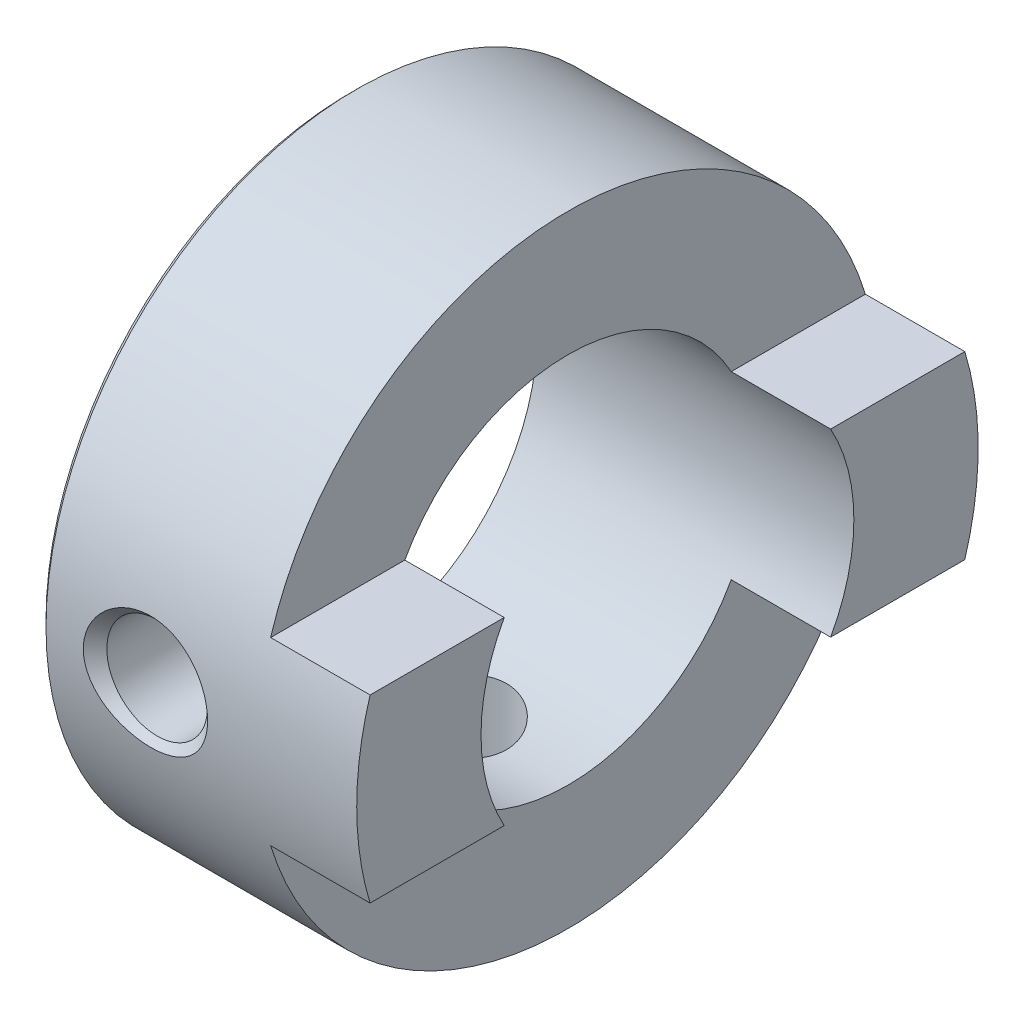
ISO-10303-21;
HEADER;
FILE_DESCRIPTION(('STEP AP214'),'2;1');
FILE_NAME('part.step','',(''),(''),'','','');
FILE_SCHEMA(('AUTOMOTIVE_DESIGN { 1 0 10303 214 1 1 1 1 }'));
ENDSEC;
DATA;
#1=APPLICATION_CONTEXT('core data for automotive mechanical design processes');
#2=APPLICATION_PROTOCOL_DEFINITION('international standard','automotive_design',2000,#1);
#3=PRODUCT_CONTEXT('',#1,'mechanical');
#4=PRODUCT('Part','Part','',(#3));
#5=PRODUCT_RELATED_PRODUCT_CATEGORY('part','',(#4));
#6=PRODUCT_DEFINITION_FORMATION('','',#4);
#7=PRODUCT_DEFINITION_CONTEXT('part definition',#1,'design');
#8=PRODUCT_DEFINITION('design','',#6,#7);
#9=PRODUCT_DEFINITION_SHAPE('','',#8);
#10=(LENGTH_UNIT() NAMED_UNIT(*) SI_UNIT(.MILLI.,.METRE.));
#11=(NAMED_UNIT(*) PLANE_ANGLE_UNIT() SI_UNIT($,.RADIAN.));
#12=(NAMED_UNIT(*) SI_UNIT($,.STERADIAN.) SOLID_ANGLE_UNIT());
#13=UNCERTAINTY_MEASURE_WITH_UNIT(LENGTH_MEASURE(1.E-05),#10,'distance_accuracy_value','');
#14=(GEOMETRIC_REPRESENTATION_CONTEXT(3) GLOBAL_UNCERTAINTY_ASSIGNED_CONTEXT((#13)) GLOBAL_UNIT_ASSIGNED_CONTEXT((#10,
#11,#12)) REPRESENTATION_CONTEXT('',''));
#15=CARTESIAN_POINT('',(0.,0.,0.));
#16=DIRECTION('',(0.,0.,1.));
#17=DIRECTION('',(1.,0.,0.));
#18=AXIS2_PLACEMENT_3D('',#15,#16,#17);
#19=CARTESIAN_POINT('',(10.2,0.,0.));
#20=DIRECTION('',(-1.,0.,0.));
#21=DIRECTION('',(0.,0.,1.));
#22=AXIS2_PLACEMENT_3D('',#19,#20,#21);
#23=CYLINDRICAL_SURFACE('',#22,6.);
#24=CARTESIAN_POINT('',(5.021,0.,6.));
#25=CARTESIAN_POINT('',(5.02099797128969,-0.0893178155734748,5.99999869766671));
#26=CARTESIAN_POINT('',(5.01359309732777,-0.178657194675937,5.99798600953487));
#27=CARTESIAN_POINT('',(4.98422344309247,-0.354759509310627,5.99015257126376));
#28=CARTESIAN_POINT('',(4.96225192551784,-0.44152123322692,5.98433005903733));
#29=CARTESIAN_POINT('',(4.90451758434842,-0.60990103470308,5.96951916261518));
#30=CARTESIAN_POINT('',(4.86877280377917,-0.691525679787921,5.96053492162512));
#31=CARTESIAN_POINT('',(4.78457421147819,-0.847621750129845,5.94034845696021));
#32=CARTESIAN_POINT('',(4.73611946430083,-0.922092648324216,5.92914607004609));
#33=CARTESIAN_POINT('',(4.62666183586585,-1.0635356052801,5.90543389683063));
#34=CARTESIAN_POINT('',(4.56541312476875,-1.13031360410209,5.89290130274946));
#35=CARTESIAN_POINT('',(4.43263153576884,-1.25278598900679,5.86808659508087));
#36=CARTESIAN_POINT('',(4.36109729867565,-1.30847890791856,5.85580451484316));
#37=CARTESIAN_POINT('',(4.20821701200546,-1.40815381279465,5.83264738302036));
#38=CARTESIAN_POINT('',(4.12671977339304,-1.45191119704436,5.82180106621877));
#39=CARTESIAN_POINT('',(3.95718459810715,-1.5250257465979,5.80307942536656));
#40=CARTESIAN_POINT('',(3.86914790663358,-1.55438564532451,5.79520353743323));
#41=CARTESIAN_POINT('',(3.69118522189785,-1.59719525057127,5.78355019076216));
#42=CARTESIAN_POINT('',(3.6013500936885,-1.61099741380277,5.77968210751179));
#43=CARTESIAN_POINT('',(3.42056257149747,-1.62339878491541,5.77621168000457));
#44=CARTESIAN_POINT('',(3.32961039562181,-1.62200091494071,5.77660851583432));
#45=CARTESIAN_POINT('',(3.15193273697882,-1.60432141484187,5.78154205648002));
#46=CARTESIAN_POINT('',(3.06516083967689,-1.58846772522148,5.78595972445398));
#47=CARTESIAN_POINT('',(2.89555679855742,-1.54301261441731,5.79824637257391));
#48=CARTESIAN_POINT('',(2.8127249776326,-1.51341006863516,5.80611563504281));
#49=CARTESIAN_POINT('',(2.65224382489695,-1.44095225763224,5.82452249254489));
#50=CARTESIAN_POINT('',(2.57466526983474,-1.39794810460614,5.83508981113179));
#51=CARTESIAN_POINT('',(2.42767590097968,-1.30001163104086,5.8576863033876));
#52=CARTESIAN_POINT('',(2.35826673755287,-1.24507690666454,5.86971577144303));
#53=CARTESIAN_POINT('',(2.22714311552469,-1.12265684317158,5.89437537730546));
#54=CARTESIAN_POINT('',(2.16576455161414,-1.05481254542755,5.90701213368907));
#55=CARTESIAN_POINT('',(2.05518632276558,-0.909638932121591,5.93110133057478));
#56=CARTESIAN_POINT('',(2.00598716324778,-0.832309223133706,5.94255372191669));
#57=CARTESIAN_POINT('',(1.92101099151845,-0.669830766272388,5.96305737158012));
#58=CARTESIAN_POINT('',(1.88529612706271,-0.584648012712029,5.97209745709705));
#59=CARTESIAN_POINT('',(1.82879138186152,-0.409187033686591,5.98667722542695));
#60=CARTESIAN_POINT('',(1.8079981506913,-0.318909956987408,5.99221769399195));
#61=CARTESIAN_POINT('',(1.78245747159978,-0.138688433319267,5.99905458941442));
#62=CARTESIAN_POINT('',(1.77725350038695,-0.0488131654021478,6.0004717290828));
#63=CARTESIAN_POINT('',(1.78177643710448,0.130526409668287,5.99925005711715));
#64=CARTESIAN_POINT('',(1.79150175785342,0.219990759493474,5.99661167663858));
#65=CARTESIAN_POINT('',(1.82523322094882,0.394330179937581,5.98765350478806));
#66=CARTESIAN_POINT('',(1.84898351767584,0.479258455257369,5.98139970825382));
#67=CARTESIAN_POINT('',(1.90979258324628,0.643916151033864,5.96592128041494));
#68=CARTESIAN_POINT('',(1.94685281335131,0.723644999523493,5.95669632292607));
#69=CARTESIAN_POINT('',(2.03406836710344,0.877405183775287,5.9360174505753));
#70=CARTESIAN_POINT('',(2.08447044340841,0.95129092645926,5.9245226986249));
#71=CARTESIAN_POINT('',(2.19662983518082,1.08971573563863,5.90063234516808));
#72=CARTESIAN_POINT('',(2.25838945491103,1.15425290069958,5.88823656116593));
#73=CARTESIAN_POINT('',(2.39364319297356,1.27408126291954,5.86349508365652));
#74=CARTESIAN_POINT('',(2.46742569300258,1.32905001767021,5.85116126961638));
#75=CARTESIAN_POINT('',(2.62342963530192,1.42583446109678,5.82833407528389));
#76=CARTESIAN_POINT('',(2.70565073320918,1.46765068621945,5.81784061993733));
#77=CARTESIAN_POINT('',(2.8757977507616,1.53662901368237,5.8000035617364));
#78=CARTESIAN_POINT('',(2.96368766567808,1.56387502411419,5.79264197416219));
#79=CARTESIAN_POINT('',(3.14303519995224,1.60313157795705,5.78190204361637));
#80=CARTESIAN_POINT('',(3.23449187147609,1.6151461409345,5.77852264976372));
#81=CARTESIAN_POINT('',(3.41507104766682,1.62336310160736,5.7762191499436));
#82=CARTESIAN_POINT('',(3.50416842282545,1.62008442858768,5.7771488220902));
#83=CARTESIAN_POINT('',(3.68048917065991,1.59901521817866,5.78301542833379));
#84=CARTESIAN_POINT('',(3.76771259393585,1.58122507313222,5.78795225409038));
#85=CARTESIAN_POINT('',(3.93713697149612,1.53194240358803,5.80118871626251));
#86=CARTESIAN_POINT('',(4.01937302562551,1.50056258099866,5.8094606557885));
#87=CARTESIAN_POINT('',(4.17747596673851,1.42507869802279,5.82843533580544));
#88=CARTESIAN_POINT('',(4.25334182817667,1.38097259386722,5.83913846667322));
#89=CARTESIAN_POINT('',(4.39902104871236,1.27972706921922,5.86217253803533));
#90=CARTESIAN_POINT('',(4.46858302330213,1.2222348484132,5.87454282185139));
#91=CARTESIAN_POINT('',(4.59724055279467,1.09651643684242,5.8993007508124));
#92=CARTESIAN_POINT('',(4.65633354398535,1.02828762453482,5.91168839946325));
#93=CARTESIAN_POINT('',(4.76366332079701,0.881210831733843,5.93541327051416));
#94=CARTESIAN_POINT('',(4.81163087542786,0.8021612388799,5.94672117517279));
#95=CARTESIAN_POINT('',(4.89352083722484,0.636816710416051,5.96668902060251));
#96=CARTESIAN_POINT('',(4.92745202136758,0.550526343212495,5.97535061522904));
#97=CARTESIAN_POINT('',(4.97601572387091,0.38716318842334,5.98796540211035));
#98=CARTESIAN_POINT('',(4.99284502784698,0.310776986652896,5.99244506486441));
#99=CARTESIAN_POINT('',(5.01533746999138,0.156265903088305,5.99846277981722));
#100=CARTESIAN_POINT('',(5.02100177485157,0.078141203822159,6.00000113936834));
#101=CARTESIAN_POINT('',(5.021,0.,6.));
#102=B_SPLINE_CURVE_WITH_KNOTS('',3,(#24,#25,#26,#27,#28,#29,#30,#31,#32,#33,#34,#35,#36,#37,
#38,#39,#40,#41,#42,#43,#44,#45,#46,#47,#48,#49,#50,#51,#52,#53,#54,#55,#56,#57,#58,#59,#60,#61,
#62,#63,#64,#65,#66,#67,#68,#69,#70,#71,#72,#73,#74,#75,#76,#77,#78,#79,#80,#81,#82,#83,#84,#85,
#86,#87,#88,#89,#90,#91,#92,#93,#94,#95,#96,#97,#98,#99,#100,#101),.UNSPECIFIED.,.T.,.F.,(4,2,2,
2,2,2,2,2,2,2,2,2,2,2,2,2,2,2,2,2,2,2,2,2,2,2,2,2,2,2,2,2,2,2,2,2,2,2,4),(0.,0.267666837034827,
0.535457560629673,0.802898663541019,1.07035945547648,1.34353089113733,1.61673845852414,
1.89477920728221,2.172767148386,2.44432214471736,2.71582493663529,2.97954239914872,
3.24328143643665,3.51006179059311,3.77689594707443,4.05267396774227,4.32846343071233,
4.6055088977465,4.88249213897389,5.15128067150215,5.42004063022915,5.68404301888905,
5.94807440052234,6.21737901834858,6.48673833414675,6.763909766522,7.04106989255473,
7.31661621277422,7.59208980139977,7.85828536269188,8.12447372716245,8.38849558902952,
8.65255987494063,8.92458415314723,9.1966749546067,9.47478799685191,9.75272687049906,
9.98692421048726,10.2210970766157),.UNSPECIFIED.);
#103=CARTESIAN_POINT('',(5.021,0.,6.));
#104=VERTEX_POINT('',#103);
#105=EDGE_CURVE('E147',#104,#104,#102,.T.);
#106=ORIENTED_EDGE('',*,*,#105,.F.);
#107=EDGE_LOOP('',(#106));
#108=FACE_BOUND('',#107,.T.);
#109=CARTESIAN_POINT('',(0.,0.,0.));
#110=DIRECTION('',(-1.,0.,0.));
#111=DIRECTION('',(0.,0.,1.));
#112=AXIS2_PLACEMENT_3D('',#109,#110,#111);
#113=CIRCLE('',#112,6.);
#114=CARTESIAN_POINT('',(0.,0.,6.));
#115=VERTEX_POINT('',#114);
#116=EDGE_CURVE('E200',#115,#115,#113,.T.);
#117=ORIENTED_EDGE('',*,*,#116,.T.);
#118=EDGE_LOOP('',(#117));
#119=FACE_BOUND('',#118,.T.);
#120=DIRECTION('',(-1.,0.,0.));
#121=VECTOR('',#120,1.);
#122=CARTESIAN_POINT('',(10.2,2.9,-5.25261839466756));
#123=LINE('',#122,#121);
#124=CARTESIAN_POINT('',(7.,2.9,-5.25261839466756));
#125=VERTEX_POINT('',#124);
#126=CARTESIAN_POINT('',(10.2,2.9,-5.25261839466756));
#127=VERTEX_POINT('',#126);
#128=EDGE_CURVE('E215',#125,#127,#123,.F.);
#129=ORIENTED_EDGE('',*,*,#128,.F.);
#130=CARTESIAN_POINT('',(7.,0.,0.));
#131=DIRECTION('',(1.,0.,0.));
#132=DIRECTION('',(0.,0.,-1.));
#133=AXIS2_PLACEMENT_3D('',#130,#131,#132);
#134=CIRCLE('',#133,6.);
#135=CARTESIAN_POINT('',(7.,2.9,5.25261839466756));
#136=VERTEX_POINT('',#135);
#137=EDGE_CURVE('E213',#136,#125,#134,.F.);
#138=ORIENTED_EDGE('',*,*,#137,.F.);
#139=DIRECTION('',(-1.,0.,0.));
#140=VECTOR('',#139,1.);
#141=CARTESIAN_POINT('',(10.2,2.9,5.25261839466756));
#142=LINE('',#141,#140);
#143=CARTESIAN_POINT('',(10.2,2.9,5.25261839466756));
#144=VERTEX_POINT('',#143);
#145=EDGE_CURVE('E217',#144,#136,#142,.T.);
#146=ORIENTED_EDGE('',*,*,#145,.F.);
#147=CARTESIAN_POINT('',(10.2,0.,0.));
#148=DIRECTION('',(-1.,0.,0.));
#149=DIRECTION('',(0.,0.,1.));
#150=AXIS2_PLACEMENT_3D('',#147,#148,#149);
#151=CIRCLE('',#150,6.);
#152=CARTESIAN_POINT('',(10.2,-2.9,5.25261839466756));
#153=VERTEX_POINT('',#152);
#154=EDGE_CURVE('E113',#153,#144,#151,.T.);
#155=ORIENTED_EDGE('',*,*,#154,.F.);
#156=DIRECTION('',(-1.,0.,0.));
#157=VECTOR('',#156,1.);
#158=CARTESIAN_POINT('',(10.2,-2.9,5.25261839466756));
#159=LINE('',#158,#157);
#160=CARTESIAN_POINT('',(7.,-2.9,5.25261839466756));
#161=VERTEX_POINT('',#160);
#162=EDGE_CURVE('E122',#161,#153,#159,.F.);
#163=ORIENTED_EDGE('',*,*,#162,.F.);
#164=CARTESIAN_POINT('',(7.,-2.9,-5.25261839466756));
#165=VERTEX_POINT('',#164);
#166=EDGE_CURVE('E212',#165,#161,#134,.F.);
#167=ORIENTED_EDGE('',*,*,#166,.F.);
#168=DIRECTION('',(-1.,0.,0.));
#169=VECTOR('',#168,1.);
#170=CARTESIAN_POINT('',(10.2,-2.9,-5.25261839466756));
#171=LINE('',#170,#169);
#172=CARTESIAN_POINT('',(10.2,-2.9,-5.25261839466756));
#173=VERTEX_POINT('',#172);
#174=EDGE_CURVE('E220',#173,#165,#171,.T.);
#175=ORIENTED_EDGE('',*,*,#174,.F.);
#176=EDGE_CURVE('E205',#127,#173,#151,.T.);
#177=ORIENTED_EDGE('',*,*,#176,.F.);
#178=EDGE_LOOP('',(#129,#138,#146,#155,#163,#167,#175,#177));
#179=FACE_BOUND('',#178,.T.);
#180=CARTESIAN_POINT('',(3.4,-5.77688142512896,-1.621));
#181=CARTESIAN_POINT('',(3.31074928785364,-5.7768829276281,-1.62099793859175));
#182=CARTESIAN_POINT('',(3.22147695108925,-5.77897237577596,-1.61360380143992));
#183=CARTESIAN_POINT('',(3.04551364733211,-5.78707859280927,-1.58428065311885));
#184=CARTESIAN_POINT('',(2.95882395221638,-5.79309726435535,-1.56234460019087));
#185=CARTESIAN_POINT('',(2.79059701236661,-5.80833162683327,-1.50471387730059));
#186=CARTESIAN_POINT('',(2.70905258608303,-5.81754273973761,-1.46903890114086));
#187=CARTESIAN_POINT('',(2.55309268323497,-5.83811825276231,-1.38500504174082));
#188=CARTESIAN_POINT('',(2.47867781463297,-5.84948283627106,-1.33664507811896));
#189=CARTESIAN_POINT('',(2.33717905838054,-5.87341173164873,-1.22728632254164));
#190=CARTESIAN_POINT('',(2.27030529627221,-5.88599775995091,-1.16602034508425));
#191=CARTESIAN_POINT('',(2.14764597271455,-5.91076417527509,-1.03316310413278));
#192=CARTESIAN_POINT('',(2.09186158657116,-5.92294451918691,-0.961570747584917));
#193=CARTESIAN_POINT('',(1.99208471129839,-5.94576993756795,-0.808632185731095));
#194=CARTESIAN_POINT('',(1.94830165532409,-5.95638640952564,-0.727144706731885));
#195=CARTESIAN_POINT('',(1.87513703567838,-5.97463840943899,-0.557630283353634));
#196=CARTESIAN_POINT('',(1.84575297691104,-5.98227445380426,-0.469604474999887));
#197=CARTESIAN_POINT('',(1.80290204237024,-5.99355165775663,-0.291705935816276));
#198=CARTESIAN_POINT('',(1.78907760214562,-5.99728241459448,-0.201925112090299));
#199=CARTESIAN_POINT('',(1.77661280199322,-6.00064217938617,-0.0212462103129114));
#200=CARTESIAN_POINT('',(1.77796983612933,-6.00027189129423,0.0696516733168152));
#201=CARTESIAN_POINT('',(1.79557883888611,-5.99553670512651,0.247493691430083));
#202=CARTESIAN_POINT('',(1.81144440516776,-5.99127543892666,0.334479267237202));
#203=CARTESIAN_POINT('',(1.85699516892022,-5.9793597448202,0.504504224291571));
#204=CARTESIAN_POINT('',(1.88668116469512,-5.9717051209056,0.587543377277735));
#205=CARTESIAN_POINT('',(1.95932274369064,-5.95371012912803,0.748297896533873));
#206=CARTESIAN_POINT('',(2.00240961769642,-5.94334335692322,0.825950857993549));
#207=CARTESIAN_POINT('',(2.10052882186259,-5.92103935200535,0.973055239975892));
#208=CARTESIAN_POINT('',(2.15556353342293,-5.90910180639849,1.04250502120307));
#209=CARTESIAN_POINT('',(2.27806281600555,-5.88450482019067,1.17353816259046));
#210=CARTESIAN_POINT('',(2.34586421794717,-5.87183448458703,1.23480495750485));
#211=CARTESIAN_POINT('',(2.49090965536492,-5.84753805950616,1.34517705319259));
#212=CARTESIAN_POINT('',(2.56815429798157,-5.83591203725511,1.39428157139381));
#213=CARTESIAN_POINT('',(2.73059443095785,-5.8149759657878,1.47918479114433));
#214=CARTESIAN_POINT('',(2.81583815981495,-5.80568139825314,1.5148952882442));
#215=CARTESIAN_POINT('',(2.99143365665319,-5.7906518698949,1.57137345510609));
#216=CARTESIAN_POINT('',(3.08178411290352,-5.78491599946566,1.59214494350626));
#217=CARTESIAN_POINT('',(3.26206243743006,-5.77784768830636,1.61760520024794));
#218=CARTESIAN_POINT('',(3.35191848285343,-5.77638575173835,1.62276709515134));
#219=CARTESIAN_POINT('',(3.53121023642439,-5.77767614995173,1.61816697027165));
#220=CARTESIAN_POINT('',(3.62064598957562,-5.78042802271884,1.60840658661066));
#221=CARTESIAN_POINT('',(3.79472078375269,-5.78971068224873,1.57465652375078));
#222=CARTESIAN_POINT('',(3.87941980840558,-5.79616534645141,1.55095324269409));
#223=CARTESIAN_POINT('',(4.04363946942751,-5.81205149115469,1.49031324664618));
#224=CARTESIAN_POINT('',(4.12315941476857,-5.82148336791764,1.45337476998254));
#225=CARTESIAN_POINT('',(4.27673760491913,-5.84252551639257,1.36635879908079));
#226=CARTESIAN_POINT('',(4.35063285505294,-5.85417999788501,1.31600456822981));
#227=CARTESIAN_POINT('',(4.48909842992388,-5.87825111047945,1.20392802733522));
#228=CARTESIAN_POINT('',(4.55366694941474,-5.89066788846766,1.14220352175118));
#229=CARTESIAN_POINT('',(4.67362064578298,-5.91531185486218,1.00694650047337));
#230=CARTESIAN_POINT('',(4.72867532067276,-5.92752240263502,0.933117232618219));
#231=CARTESIAN_POINT('',(4.82561101171815,-5.94999961178858,0.776991184828818));
#232=CARTESIAN_POINT('',(4.867492729254,-5.96026637665238,0.694694856024059));
#233=CARTESIAN_POINT('',(4.93650566332042,-5.97763303477258,0.524550068134776));
#234=CARTESIAN_POINT('',(4.96374753278206,-5.98475660978017,0.436749025845999));
#235=CARTESIAN_POINT('',(5.0030256550677,-5.99513856617432,0.257593525566361));
#236=CARTESIAN_POINT('',(5.01506537353331,-5.99839782849975,0.166239882360433));
#237=CARTESIAN_POINT('',(5.0233755616105,-6.00064111385202,-0.0143434803728219));
#238=CARTESIAN_POINT('',(5.02013023682755,-5.99975641584032,-0.103549597851227));
#239=CARTESIAN_POINT('',(4.99909005802016,-5.99410932073252,-0.280096975558482));
#240=CARTESIAN_POINT('',(4.98129577623505,-5.98934707614805,-0.367438308994348));
#241=CARTESIAN_POINT('',(4.93193944964188,-5.97650723807709,-0.537178076094956));
#242=CARTESIAN_POINT('',(4.90047794281298,-5.9684538796408,-0.619607698889977));
#243=CARTESIAN_POINT('',(4.8247698627264,-5.94987279513439,-0.778065108682511));
#244=CARTESIAN_POINT('',(4.78052146036038,-5.93934471510661,-0.854091977783952));
#245=CARTESIAN_POINT('',(4.67909140492859,-5.91658102409864,-0.999830646388225));
#246=CARTESIAN_POINT('',(4.62159038778948,-5.9043067232668,-1.06931411403895));
#247=CARTESIAN_POINT('',(4.49588994732214,-5.87958699262767,-1.19780937123827));
#248=CARTESIAN_POINT('',(4.4276876882196,-5.86714151826009,-1.25681837624874));
#249=CARTESIAN_POINT('',(4.28065525420729,-5.84316191487849,-1.36402029923082));
#250=CARTESIAN_POINT('',(4.20161866992622,-5.83165494520731,-1.41193674811838));
#251=CARTESIAN_POINT('',(4.0363100914389,-5.81124311033911,-1.49373441183743));
#252=CARTESIAN_POINT('',(3.95004275279216,-5.80233658714514,-1.52762457535204));
#253=CARTESIAN_POINT('',(3.78677742337144,-5.78933612981829,-1.57610599847278));
#254=CARTESIAN_POINT('',(3.71046976735289,-5.78470400323569,-1.5929010777466));
#255=CARTESIAN_POINT('',(3.55611344752289,-5.7784761776529,-1.61534830532273));
#256=CARTESIAN_POINT('',(3.47806499570857,-5.77688011093677,-1.6210018030537));
#257=CARTESIAN_POINT('',(3.4,-5.77688142512896,-1.621));
#258=B_SPLINE_CURVE_WITH_KNOTS('',3,(#180,#181,#182,#183,#184,#185,#186,#187,#188,#189,#190,
#191,#192,#193,#194,#195,#196,#197,#198,#199,#200,#201,#202,#203,#204,#205,#206,#207,#208,#209,
#210,#211,#212,#213,#214,#215,#216,#217,#218,#219,#220,#221,#222,#223,#224,#225,#226,#227,#228,
#229,#230,#231,#232,#233,#234,#235,#236,#237,#238,#239,#240,#241,#242,#243,#244,#245,#246,#247,
#248,#249,#250,#251,#252,#253,#254,#255,#256,#257),.UNSPECIFIED.,.T.,.F.,(4,2,2,2,2,2,2,2,2,2,2,
2,2,2,2,2,2,2,2,2,2,2,2,2,2,2,2,2,2,2,2,2,2,2,2,2,2,2,4),(0.,0.267464992695703,
0.535059596997505,0.80227204201698,1.06950725293927,1.34294216525684,1.61640604210261,
1.89437564440429,2.17229706235756,2.44369233612858,2.71504102497131,2.97936698259172,
3.24370821026407,3.51072546491853,3.77779598943322,4.05327621233184,4.32877415618656,
4.60605576246915,4.88326646613497,5.151986194857,5.42067646247782,5.68403137508195,
5.94742135460564,6.21673322138912,6.48609714549701,6.76347775585127,7.04084359486591,
7.31608242237236,7.59125849221654,7.85777713564118,8.12428529686341,8.38886533295362,
8.65348323478742,8.92530669838273,9.19720231583785,9.47528078444512,9.75318156620756,
9.98715373669031,10.2210975675557),.UNSPECIFIED.);
#259=CARTESIAN_POINT('',(3.4,-5.77688142512896,-1.621));
#260=VERTEX_POINT('',#259);
#261=EDGE_CURVE('E35',#260,#260,#258,.T.);
#262=ORIENTED_EDGE('',*,*,#261,.F.);
#263=EDGE_LOOP('',(#262));
#264=FACE_BOUND('',#263,.T.);
#265=ADVANCED_FACE('F31',(#108,#119,#179,#264),#23,.F.);
#266=CARTESIAN_POINT('',(10.2,0.,0.));
#267=DIRECTION('',(-1.,0.,0.));
#268=DIRECTION('',(0.,0.,1.));
#269=AXIS2_PLACEMENT_3D('',#266,#267,#268);
#270=CYLINDRICAL_SURFACE('',#269,10.);
#271=CARTESIAN_POINT('',(2.04203605263134,-1.34241325962392,9.90948670710666));
#272=CARTESIAN_POINT('',(2.11375542397122,-1.403240523465,9.90124691995362));
#273=CARTESIAN_POINT('',(2.18989182528834,-1.45890211933818,9.89313764082208));
#274=CARTESIAN_POINT('',(2.34925532035735,-1.55916960172842,9.8778320646358));
#275=CARTESIAN_POINT('',(2.43248860925503,-1.60376569319462,9.87063657919076));
#276=CARTESIAN_POINT('',(2.6219925848851,-1.68930210928572,9.85639502389072));
#277=CARTESIAN_POINT('',(2.72948553219465,-1.72761385701575,9.84968268006661));
#278=CARTESIAN_POINT('',(2.94933651346637,-1.78669335920088,9.83913761976317));
#279=CARTESIAN_POINT('',(3.0616966654432,-1.80745339356143,9.83530617052286));
#280=CARTESIAN_POINT('',(3.29308990862618,-1.83156785115371,9.83084559805247));
#281=CARTESIAN_POINT('',(3.41220590990035,-1.8341605770526,9.83035663452192));
#282=CARTESIAN_POINT('',(3.64922601441559,-1.81986799512386,9.83301223260815));
#283=CARTESIAN_POINT('',(3.76713003270237,-1.80298133114981,9.83615704720695));
#284=CARTESIAN_POINT('',(3.9996034290027,-1.7497602257805,9.84576428779239));
#285=CARTESIAN_POINT('',(4.11412681675671,-1.7132301395102,9.85226006178363));
#286=CARTESIAN_POINT('',(4.33516048902334,-1.62125375202364,9.86781136761335));
#287=CARTESIAN_POINT('',(4.44167025728316,-1.56580623338128,9.8768670641885));
#288=CARTESIAN_POINT('',(4.64111082233285,-1.43837265465425,9.89621846873361));
#289=CARTESIAN_POINT('',(4.7342751492373,-1.36674877708146,9.90648496446691));
#290=CARTESIAN_POINT('',(4.90614866938823,-1.20782961406183,9.92711143478405));
#291=CARTESIAN_POINT('',(4.98486323457534,-1.12054017651392,9.93747137312015));
#292=CARTESIAN_POINT('',(5.11980395338148,-0.938642082082796,9.95624141112421));
#293=CARTESIAN_POINT('',(5.17716449208623,-0.844885941486473,9.96473473462322));
#294=CARTESIAN_POINT('',(5.27349691200858,-0.648199010207064,9.97945483045475));
#295=CARTESIAN_POINT('',(5.3124837120208,-0.545275743915212,9.98568344070818));
#296=CARTESIAN_POINT('',(5.3671729789784,-0.343874247360195,9.9945446223789));
#297=CARTESIAN_POINT('',(5.38474953322585,-0.245915988420423,9.99746472104146));
#298=CARTESIAN_POINT('',(5.4022361149181,-0.0484041411381668,10.0003695536457));
#299=CARTESIAN_POINT('',(5.40215363738717,0.0511487524536561,10.000355532916));
#300=CARTESIAN_POINT('',(5.38489896220358,0.242476170784844,9.99748983101426));
#301=CARTESIAN_POINT('',(5.36878332134464,0.334351156623259,9.99481358692744));
#302=CARTESIAN_POINT('',(5.32176601831496,0.51412060714981,9.98718069962873));
#303=CARTESIAN_POINT('',(5.29086388026823,0.602014943628468,9.98222398302425));
#304=CARTESIAN_POINT('',(5.21493293386297,0.773019711530929,9.97045207609644));
#305=CARTESIAN_POINT('',(5.1696839939923,0.856029931496645,9.9636081583261));
#306=CARTESIAN_POINT('',(5.06689422375728,1.01392340385955,9.9487818170687));
#307=CARTESIAN_POINT('',(5.00934989283831,1.08880433263463,9.94079906956711));
#308=CARTESIAN_POINT('',(4.87894894150659,1.23447162688709,9.9238030932501));
#309=CARTESIAN_POINT('',(4.80525754097539,1.3045061687632,9.91475775416407));
#310=CARTESIAN_POINT('',(4.64794441919632,1.43240822380913,9.89708970173511));
#311=CARTESIAN_POINT('',(4.5643189231435,1.49027108863773,9.88846715081479));
#312=CARTESIAN_POINT('',(4.38153418471773,1.59752765702108,9.8717333045712));
#313=CARTESIAN_POINT('',(4.28165500297367,1.64571393946365,9.86373530170333));
#314=CARTESIAN_POINT('',(4.0754385309667,1.72585895137402,9.85002883016572));
#315=CARTESIAN_POINT('',(3.96909936359708,1.75781293865579,9.84432103066997));
#316=CARTESIAN_POINT('',(3.74621625177177,1.80638838383251,9.83552836788217));
#317=CARTESIAN_POINT('',(3.62944128411396,1.82198683566234,9.83261936137998));
#318=CARTESIAN_POINT('',(3.39486487494573,1.83412123663999,9.83036296012612));
#319=CARTESIAN_POINT('',(3.27706327585451,1.83065420601992,9.83101612211003));
#320=CARTESIAN_POINT('',(3.04119864761494,1.80444216325199,9.83586147731257));
#321=CARTESIAN_POINT('',(2.92318121054954,1.78129740459865,9.84012704833762));
#322=CARTESIAN_POINT('',(2.69280878150543,1.71561219037197,9.8517906665897));
#323=CARTESIAN_POINT('',(2.58045431638512,1.67306993382479,9.85918900467606));
#324=CARTESIAN_POINT('',(2.36581493938337,1.56983517700697,9.87614901728429));
#325=CARTESIAN_POINT('',(2.26344879419886,1.50930878895272,9.88569070578194));
#326=CARTESIAN_POINT('',(2.07108333350251,1.37112070640718,9.90580054499222));
#327=CARTESIAN_POINT('',(1.981081936517,1.29346190172542,9.91636852242754));
#328=CARTESIAN_POINT('',(1.82099876692076,1.12690342645504,9.93663756302797));
#329=CARTESIAN_POINT('',(1.75016033608861,1.03873541573407,9.94635578054492));
#330=CARTESIAN_POINT('',(1.62601158238275,0.850665231116957,9.96419833690671));
#331=CARTESIAN_POINT('',(1.57268827734222,0.750771822939427,9.97232385444711));
#332=CARTESIAN_POINT('',(1.49029274114702,0.551870768735924,9.98521137796381));
#333=CARTESIAN_POINT('',(1.45945480092119,0.453610249008211,9.99021223200516));
#334=CARTESIAN_POINT('',(1.41614576973022,0.253033165393579,9.99730024771955));
#335=CARTESIAN_POINT('',(1.40366301836498,0.150719218970854,9.99938925913892));
#336=CARTESIAN_POINT('',(1.39796920562316,-0.0460911958730754,10.0003387207038));
#337=CARTESIAN_POINT('',(1.40327326406868,-0.140546655337177,9.99944794550816));
#338=CARTESIAN_POINT('',(1.42967176301348,-0.327159425861631,9.9950825821691));
#339=CARTESIAN_POINT('',(1.45076629170412,-0.419316724083549,9.99160797959474));
#340=CARTESIAN_POINT('',(1.5074595833349,-0.597749488664115,9.98251470494415));
#341=CARTESIAN_POINT('',(1.54289103337312,-0.684079834897608,9.97692081156793));
#342=CARTESIAN_POINT('',(1.62683683955861,-0.849951171873044,9.96416112679107));
#343=CARTESIAN_POINT('',(1.67534805042054,-0.92949378881176,9.95699571337045));
#344=CARTESIAN_POINT('',(1.77446616135076,-1.06727958089582,9.94308117256719));
#345=CARTESIAN_POINT('',(1.82328764631752,-1.12683634457346,9.93647131377168));
#346=CARTESIAN_POINT('',(1.92776912327518,-1.23954884818016,9.92304079303933));
#347=CARTESIAN_POINT('',(1.98342774504566,-1.29270586645815,9.91622017354513));
#348=CARTESIAN_POINT('',(2.04203605263134,-1.34241325962392,9.90948670710666));
#349=B_SPLINE_CURVE_WITH_KNOTS('',3,(#271,#272,#273,#274,#275,#276,#277,#278,#279,#280,#281,
#282,#283,#284,#285,#286,#287,#288,#289,#290,#291,#292,#293,#294,#295,#296,#297,#298,#299,#300,
#301,#302,#303,#304,#305,#306,#307,#308,#309,#310,#311,#312,#313,#314,#315,#316,#317,#318,#319,
#320,#321,#322,#323,#324,#325,#326,#327,#328,#329,#330,#331,#332,#333,#334,#335,#336,#337,#338,
#339,#340,#341,#342,#343,#344,#345,#346,#347,#348),.UNSPECIFIED.,.T.,.F.,(4,2,2,2,2,2,2,2,2,2,2,
2,2,2,2,2,2,2,2,2,2,2,2,2,2,2,2,2,2,2,2,2,2,2,2,2,2,2,4),(0.,0.282999987596324,
0.566249596778663,0.907629818392951,1.24916011757754,1.60492837412329,1.9607214005912,
2.3201255333534,2.6795527998328,3.03161485312538,3.38354575521571,3.7124512028387,
4.04108912935102,4.33821745723761,4.63521967517437,4.91386546974415,5.19252023261509,
5.47567624116556,5.75891297321336,6.06382400948452,6.36885128016056,6.70095008860706,
7.0331458623877,7.38506553177243,7.73704020468186,8.0963408157774,8.45567479317689,
8.81178779539873,9.16784077614117,9.5065530851701,9.84501377199465,10.1526644919369,
10.4601196877335,10.7425680964228,11.0250180826268,11.3042627819106,11.5834403911198,
11.8147512527918,12.0460158331962),.UNSPECIFIED.);
#350=CARTESIAN_POINT('',(2.04203605263134,-1.34241325962392,9.90948670710666));
#351=VERTEX_POINT('',#350);
#352=EDGE_CURVE('E44',#351,#351,#349,.T.);
#353=ORIENTED_EDGE('',*,*,#352,.F.);
#354=EDGE_LOOP('',(#353));
#355=FACE_BOUND('',#354,.T.);
#356=CARTESIAN_POINT('',(0.200000000000001,0.,0.));
#357=DIRECTION('',(-1.,0.,0.));
#358=DIRECTION('',(0.,0.,1.));
#359=AXIS2_PLACEMENT_3D('',#356,#357,#358);
#360=CIRCLE('',#359,10.);
#361=CARTESIAN_POINT('',(0.200000000000001,0.,10.));
#362=VERTEX_POINT('',#361);
#363=EDGE_CURVE('E209',#362,#362,#360,.T.);
#364=ORIENTED_EDGE('',*,*,#363,.F.);
#365=EDGE_LOOP('',(#364));
#366=FACE_BOUND('',#365,.T.);
#367=DIRECTION('',(-1.,0.,0.));
#368=VECTOR('',#367,1.);
#369=CARTESIAN_POINT('',(10.2,2.9,-9.57026645397086));
#370=LINE('',#369,#368);
#371=CARTESIAN_POINT('',(10.2,2.9,-9.57026645397086));
#372=VERTEX_POINT('',#371);
#373=CARTESIAN_POINT('',(7.,2.9,-9.57026645397086));
#374=VERTEX_POINT('',#373);
#375=EDGE_CURVE('E139',#372,#374,#370,.T.);
#376=ORIENTED_EDGE('',*,*,#375,.F.);
#377=CARTESIAN_POINT('',(10.2,0.,0.));
#378=DIRECTION('',(-1.,0.,0.));
#379=DIRECTION('',(0.,0.,1.));
#380=AXIS2_PLACEMENT_3D('',#377,#378,#379);
#381=CIRCLE('',#380,10.);
#382=CARTESIAN_POINT('',(10.2,-2.9,-9.57026645397086));
#383=VERTEX_POINT('',#382);
#384=EDGE_CURVE('E114',#372,#383,#381,.T.);
#385=ORIENTED_EDGE('',*,*,#384,.T.);
#386=DIRECTION('',(-1.,0.,0.));
#387=VECTOR('',#386,1.);
#388=CARTESIAN_POINT('',(10.2,-2.9,-9.57026645397086));
#389=LINE('',#388,#387);
#390=CARTESIAN_POINT('',(7.,-2.9,-9.57026645397086));
#391=VERTEX_POINT('',#390);
#392=EDGE_CURVE('E135',#391,#383,#389,.F.);
#393=ORIENTED_EDGE('',*,*,#392,.F.);
#394=CARTESIAN_POINT('',(7.,0.,0.));
#395=DIRECTION('',(1.,0.,0.));
#396=DIRECTION('',(0.,0.,-1.));
#397=AXIS2_PLACEMENT_3D('',#394,#395,#396);
#398=CIRCLE('',#397,10.);
#399=CARTESIAN_POINT('',(7.,-2.9,9.57026645397086));
#400=VERTEX_POINT('',#399);
#401=EDGE_CURVE('E130',#400,#391,#398,.T.);
#402=ORIENTED_EDGE('',*,*,#401,.F.);
#403=DIRECTION('',(-1.,0.,0.));
#404=VECTOR('',#403,1.);
#405=CARTESIAN_POINT('',(10.2,-2.9,9.57026645397086));
#406=LINE('',#405,#404);
#407=CARTESIAN_POINT('',(10.2,-2.9,9.57026645397086));
#408=VERTEX_POINT('',#407);
#409=EDGE_CURVE('E119',#408,#400,#406,.T.);
#410=ORIENTED_EDGE('',*,*,#409,.F.);
#411=CARTESIAN_POINT('',(10.2,2.9,9.57026645397086));
#412=VERTEX_POINT('',#411);
#413=EDGE_CURVE('E103',#408,#412,#381,.T.);
#414=ORIENTED_EDGE('',*,*,#413,.T.);
#415=DIRECTION('',(-1.,0.,0.));
#416=VECTOR('',#415,1.);
#417=CARTESIAN_POINT('',(10.2,2.9,9.57026645397086));
#418=LINE('',#417,#416);
#419=CARTESIAN_POINT('',(7.,2.9,9.57026645397086));
#420=VERTEX_POINT('',#419);
#421=EDGE_CURVE('E131',#420,#412,#418,.F.);
#422=ORIENTED_EDGE('',*,*,#421,.F.);
#423=EDGE_CURVE('E133',#374,#420,#398,.T.);
#424=ORIENTED_EDGE('',*,*,#423,.F.);
#425=EDGE_LOOP('',(#376,#385,#393,#402,#410,#414,#422,#424));
#426=FACE_BOUND('',#425,.T.);
#427=CARTESIAN_POINT('',(2.04203605263134,-9.90948670710666,-1.34241325962392));
#428=CARTESIAN_POINT('',(2.11375542397122,-9.90124691995362,-1.403240523465));
#429=CARTESIAN_POINT('',(2.18989182528834,-9.89313764082208,-1.45890211933818));
#430=CARTESIAN_POINT('',(2.34925532035735,-9.8778320646358,-1.55916960172842));
#431=CARTESIAN_POINT('',(2.43248860925503,-9.87063657919076,-1.60376569319462));
#432=CARTESIAN_POINT('',(2.6219925848851,-9.85639502389072,-1.68930210928572));
#433=CARTESIAN_POINT('',(2.72948553219465,-9.84968268006661,-1.72761385701576));
#434=CARTESIAN_POINT('',(2.94933651346637,-9.83913761976317,-1.78669335920088));
#435=CARTESIAN_POINT('',(3.0616966654432,-9.83530617052286,-1.80745339356143));
#436=CARTESIAN_POINT('',(3.29308990862618,-9.83084559805247,-1.83156785115371));
#437=CARTESIAN_POINT('',(3.41220590990035,-9.83035663452193,-1.8341605770526));
#438=CARTESIAN_POINT('',(3.64922601441559,-9.83301223260815,-1.81986799512386));
#439=CARTESIAN_POINT('',(3.76713003270237,-9.83615704720695,-1.80298133114981));
#440=CARTESIAN_POINT('',(3.9996034290027,-9.84576428779239,-1.7497602257805));
#441=CARTESIAN_POINT('',(4.11412681675671,-9.85226006178363,-1.7132301395102));
#442=CARTESIAN_POINT('',(4.33516048902334,-9.86781136761335,-1.62125375202364));
#443=CARTESIAN_POINT('',(4.44167025728316,-9.8768670641885,-1.56580623338127));
#444=CARTESIAN_POINT('',(4.64111082233285,-9.89621846873361,-1.43837265465425));
#445=CARTESIAN_POINT('',(4.7342751492373,-9.90648496446691,-1.36674877708145));
#446=CARTESIAN_POINT('',(4.90614866938823,-9.92711143478405,-1.20782961406183));
#447=CARTESIAN_POINT('',(4.98486323457534,-9.93747137312015,-1.12054017651392));
#448=CARTESIAN_POINT('',(5.11980395338148,-9.95624141112421,-0.938642082082795));
#449=CARTESIAN_POINT('',(5.17716449208623,-9.96473473462322,-0.844885941486473));
#450=CARTESIAN_POINT('',(5.27349691200858,-9.97945483045475,-0.648199010207063));
#451=CARTESIAN_POINT('',(5.3124837120208,-9.98568344070818,-0.54527574391521));
#452=CARTESIAN_POINT('',(5.3671729789784,-9.9945446223789,-0.343874247360193));
#453=CARTESIAN_POINT('',(5.38474953322585,-9.99746472104146,-0.245915988420421));
#454=CARTESIAN_POINT('',(5.4022361149181,-10.0003695536457,-0.0484041411381657));
#455=CARTESIAN_POINT('',(5.40215363738717,-10.000355532916,0.0511487524536571));
#456=CARTESIAN_POINT('',(5.38489896220358,-9.99748983101426,0.242476170784845));
#457=CARTESIAN_POINT('',(5.36878332134464,-9.99481358692744,0.33435115662326));
#458=CARTESIAN_POINT('',(5.32176601831496,-9.98718069962873,0.514120607149811));
#459=CARTESIAN_POINT('',(5.29086388026823,-9.98222398302425,0.602014943628468));
#460=CARTESIAN_POINT('',(5.21493293386297,-9.97045207609644,0.77301971153093));
#461=CARTESIAN_POINT('',(5.1696839939923,-9.9636081583261,0.856029931496645));
#462=CARTESIAN_POINT('',(5.06689422375728,-9.9487818170687,1.01392340385955));
#463=CARTESIAN_POINT('',(5.00934989283831,-9.94079906956711,1.08880433263462));
#464=CARTESIAN_POINT('',(4.87894894150659,-9.9238030932501,1.23447162688709));
#465=CARTESIAN_POINT('',(4.80525754097539,-9.91475775416407,1.30450616876321));
#466=CARTESIAN_POINT('',(4.64794441919632,-9.89708970173511,1.43240822380913));
#467=CARTESIAN_POINT('',(4.5643189231435,-9.88846715081479,1.49027108863773));
#468=CARTESIAN_POINT('',(4.38153418471773,-9.87173330457119,1.59752765702109));
#469=CARTESIAN_POINT('',(4.28165500297367,-9.86373530170333,1.64571393946365));
#470=CARTESIAN_POINT('',(4.0754385309667,-9.85002883016572,1.72585895137402));
#471=CARTESIAN_POINT('',(3.96909936359708,-9.84432103066997,1.75781293865579));
#472=CARTESIAN_POINT('',(3.74621625177177,-9.83552836788217,1.80638838383251));
#473=CARTESIAN_POINT('',(3.62944128411395,-9.83261936137998,1.82198683566234));
#474=CARTESIAN_POINT('',(3.39486487494573,-9.83036296012612,1.83412123663999));
#475=CARTESIAN_POINT('',(3.27706327585451,-9.83101612211003,1.83065420601992));
#476=CARTESIAN_POINT('',(3.04119864761494,-9.83586147731257,1.80444216325199));
#477=CARTESIAN_POINT('',(2.92318121054954,-9.84012704833762,1.78129740459865));
#478=CARTESIAN_POINT('',(2.69280878150543,-9.8517906665897,1.71561219037198));
#479=CARTESIAN_POINT('',(2.58045431638512,-9.85918900467606,1.67306993382479));
#480=CARTESIAN_POINT('',(2.36581493938337,-9.87614901728429,1.56983517700697));
#481=CARTESIAN_POINT('',(2.26344879419886,-9.88569070578194,1.50930878895272));
#482=CARTESIAN_POINT('',(2.07108333350251,-9.90580054499222,1.37112070640718));
#483=CARTESIAN_POINT('',(1.981081936517,-9.91636852242754,1.29346190172542));
#484=CARTESIAN_POINT('',(1.82099876692076,-9.93663756302797,1.12690342645504));
#485=CARTESIAN_POINT('',(1.75016033608861,-9.94635578054492,1.03873541573407));
#486=CARTESIAN_POINT('',(1.62601158238275,-9.96419833690671,0.850665231116957));
#487=CARTESIAN_POINT('',(1.57268827734222,-9.97232385444711,0.750771822939427));
#488=CARTESIAN_POINT('',(1.49029274114702,-9.98521137796381,0.551870768735924));
#489=CARTESIAN_POINT('',(1.45945480092119,-9.99021223200516,0.453610249008211));
#490=CARTESIAN_POINT('',(1.41614576973022,-9.99730024771955,0.253033165393579));
#491=CARTESIAN_POINT('',(1.40366301836498,-9.99938925913892,0.150719218970854));
#492=CARTESIAN_POINT('',(1.39796920562316,-10.0003387207038,-0.046091195873075));
#493=CARTESIAN_POINT('',(1.40327326406869,-9.99944794550816,-0.140546655337177));
#494=CARTESIAN_POINT('',(1.42967176301348,-9.9950825821691,-0.327159425861631));
#495=CARTESIAN_POINT('',(1.45076629170412,-9.99160797959474,-0.419316724083548));
#496=CARTESIAN_POINT('',(1.5074595833349,-9.98251470494415,-0.597749488664114));
#497=CARTESIAN_POINT('',(1.54289103337312,-9.97692081156793,-0.684079834897607));
#498=CARTESIAN_POINT('',(1.62683683955861,-9.96416112679107,-0.849951171873043));
#499=CARTESIAN_POINT('',(1.67534805042054,-9.95699571337045,-0.929493788811759));
#500=CARTESIAN_POINT('',(1.77446616135076,-9.94308117256719,-1.06727958089582));
#501=CARTESIAN_POINT('',(1.82328764631752,-9.93647131377168,-1.12683634457346));
#502=CARTESIAN_POINT('',(1.92776912327518,-9.92304079303933,-1.23954884818016));
#503=CARTESIAN_POINT('',(1.98342774504567,-9.91622017354513,-1.29270586645815));
#504=CARTESIAN_POINT('',(2.04203605263134,-9.90948670710666,-1.34241325962392));
#505=B_SPLINE_CURVE_WITH_KNOTS('',3,(#427,#428,#429,#430,#431,#432,#433,#434,#435,#436,#437,
#438,#439,#440,#441,#442,#443,#444,#445,#446,#447,#448,#449,#450,#451,#452,#453,#454,#455,#456,
#457,#458,#459,#460,#461,#462,#463,#464,#465,#466,#467,#468,#469,#470,#471,#472,#473,#474,#475,
#476,#477,#478,#479,#480,#481,#482,#483,#484,#485,#486,#487,#488,#489,#490,#491,#492,#493,#494,
#495,#496,#497,#498,#499,#500,#501,#502,#503,#504),.UNSPECIFIED.,.T.,.F.,(4,2,2,2,2,2,2,2,2,2,2,
2,2,2,2,2,2,2,2,2,2,2,2,2,2,2,2,2,2,2,2,2,2,2,2,2,2,2,4),(0.,0.282999987596324,
0.566249596778662,0.907629818392951,1.24916011757755,1.60492837412329,1.9607214005912,
2.3201255333534,2.67955279983281,3.03161485312538,3.38354575521571,3.7124512028387,
4.04108912935102,4.33821745723761,4.63521967517437,4.91386546974415,5.19252023261509,
5.47567624116556,5.75891297321336,6.06382400948452,6.36885128016056,6.70095008860706,
7.0331458623877,7.38506553177243,7.73704020468186,8.09634081577739,8.45567479317689,
8.81178779539872,9.16784077614116,9.5065530851701,9.84501377199464,10.1526644919369,
10.4601196877335,10.7425680964228,11.0250180826268,11.3042627819106,11.5834403911198,
11.8147512527918,12.0460158331962),.UNSPECIFIED.);
#506=CARTESIAN_POINT('',(2.04203605263134,-9.90948670710666,-1.34241325962392));
#507=VERTEX_POINT('',#506);
#508=EDGE_CURVE('E11',#507,#507,#505,.T.);
#509=ORIENTED_EDGE('',*,*,#508,.F.);
#510=EDGE_LOOP('',(#509));
#511=FACE_BOUND('',#510,.T.);
#512=ADVANCED_FACE('F127',(#355,#366,#426,#511),#270,.T.);
#513=CARTESIAN_POINT('',(10.2,6.,0.));
#514=DIRECTION('',(-1.,0.,0.));
#515=DIRECTION('',(0.,0.,1.));
#516=AXIS2_PLACEMENT_3D('',#513,#514,#515);
#517=PLANE('',#516);
#518=DIRECTION('',(0.,0.,1.));
#519=VECTOR('',#518,1.);
#520=CARTESIAN_POINT('',(10.2,2.9,-10.));
#521=LINE('',#520,#519);
#522=EDGE_CURVE('E109',#144,#412,#521,.T.);
#523=ORIENTED_EDGE('',*,*,#522,.T.);
#524=ORIENTED_EDGE('',*,*,#413,.F.);
#525=DIRECTION('',(0.,0.,-1.));
#526=VECTOR('',#525,1.);
#527=CARTESIAN_POINT('',(10.2,-2.9,10.));
#528=LINE('',#527,#526);
#529=EDGE_CURVE('E107',#408,#153,#528,.T.);
#530=ORIENTED_EDGE('',*,*,#529,.T.);
#531=ORIENTED_EDGE('',*,*,#154,.T.);
#532=EDGE_LOOP('',(#523,#524,#530,#531));
#533=FACE_BOUND('',#532,.T.);
#534=ADVANCED_FACE('F105',(#533),#517,.F.);
#535=EDGE_CURVE('E224',#372,#127,#521,.T.);
#536=ORIENTED_EDGE('',*,*,#535,.T.);
#537=ORIENTED_EDGE('',*,*,#176,.T.);
#538=EDGE_CURVE('E123',#173,#383,#528,.T.);
#539=ORIENTED_EDGE('',*,*,#538,.T.);
#540=ORIENTED_EDGE('',*,*,#384,.F.);
#541=EDGE_LOOP('',(#536,#537,#539,#540));
#542=FACE_BOUND('',#541,.T.);
#543=ADVANCED_FACE('F195',(#542),#517,.F.);
#544=CARTESIAN_POINT('',(0.200000000000001,0.,0.));
#545=DIRECTION('',(1.,0.,0.));
#546=DIRECTION('',(0.,0.,-1.));
#547=AXIS2_PLACEMENT_3D('',#544,#545,#546);
#548=CONICAL_SURFACE('',#547,10.,0.785398163397448);
#549=CARTESIAN_POINT('',(0.,0.,0.));
#550=DIRECTION('',(-1.,0.,0.));
#551=DIRECTION('',(0.,0.,1.));
#552=AXIS2_PLACEMENT_3D('',#549,#550,#551);
#553=CIRCLE('',#552,9.8);
#554=CARTESIAN_POINT('',(0.,0.,9.8));
#555=VERTEX_POINT('',#554);
#556=EDGE_CURVE('E203',#555,#555,#553,.T.);
#557=ORIENTED_EDGE('',*,*,#556,.F.);
#558=EDGE_LOOP('',(#557));
#559=FACE_BOUND('',#558,.T.);
#560=ORIENTED_EDGE('',*,*,#363,.T.);
#561=EDGE_LOOP('',(#560));
#562=FACE_BOUND('',#561,.T.);
#563=ADVANCED_FACE('F33',(#559,#562),#548,.T.);
#564=CARTESIAN_POINT('',(0.,9.8,0.));
#565=DIRECTION('',(1.,0.,0.));
#566=DIRECTION('',(0.,0.,-1.));
#567=AXIS2_PLACEMENT_3D('',#564,#565,#566);
#568=PLANE('',#567);
#569=ORIENTED_EDGE('',*,*,#116,.F.);
#570=EDGE_LOOP('',(#569));
#571=FACE_BOUND('',#570,.T.);
#572=ORIENTED_EDGE('',*,*,#556,.T.);
#573=EDGE_LOOP('',(#572));
#574=FACE_BOUND('',#573,.T.);
#575=ADVANCED_FACE('F166',(#571,#574),#568,.F.);
#576=CARTESIAN_POINT('',(7.,-2.9,10.));
#577=DIRECTION('',(0.,-1.,0.));
#578=DIRECTION('',(0.,0.,-1.));
#579=AXIS2_PLACEMENT_3D('',#576,#577,#578);
#580=PLANE('',#579);
#581=ORIENTED_EDGE('',*,*,#162,.T.);
#582=ORIENTED_EDGE('',*,*,#529,.F.);
#583=ORIENTED_EDGE('',*,*,#409,.T.);
#584=DIRECTION('',(0.,0.,-1.));
#585=VECTOR('',#584,1.);
#586=CARTESIAN_POINT('',(7.,-2.9,10.));
#587=LINE('',#586,#585);
#588=EDGE_CURVE('E221',#400,#161,#587,.T.);
#589=ORIENTED_EDGE('',*,*,#588,.T.);
#590=EDGE_LOOP('',(#581,#582,#583,#589));
#591=FACE_BOUND('',#590,.T.);
#592=ADVANCED_FACE('F117',(#591),#580,.T.);
#593=ORIENTED_EDGE('',*,*,#174,.T.);
#594=EDGE_CURVE('E59',#165,#391,#587,.T.);
#595=ORIENTED_EDGE('',*,*,#594,.T.);
#596=ORIENTED_EDGE('',*,*,#392,.T.);
#597=ORIENTED_EDGE('',*,*,#538,.F.);
#598=EDGE_LOOP('',(#593,#595,#596,#597));
#599=FACE_BOUND('',#598,.T.);
#600=ADVANCED_FACE('F165',(#599),#580,.T.);
#601=CARTESIAN_POINT('',(7.,10.5,11.));
#602=DIRECTION('',(1.,0.,0.));
#603=DIRECTION('',(0.,0.,-1.));
#604=AXIS2_PLACEMENT_3D('',#601,#602,#603);
#605=PLANE('',#604);
#606=ORIENTED_EDGE('',*,*,#166,.T.);
#607=ORIENTED_EDGE('',*,*,#588,.F.);
#608=ORIENTED_EDGE('',*,*,#401,.T.);
#609=ORIENTED_EDGE('',*,*,#594,.F.);
#610=EDGE_LOOP('',(#606,#607,#608,#609));
#611=FACE_BOUND('',#610,.T.);
#612=ADVANCED_FACE('F172',(#611),#605,.T.);
#613=ORIENTED_EDGE('',*,*,#137,.T.);
#614=DIRECTION('',(0.,0.,1.));
#615=VECTOR('',#614,1.);
#616=CARTESIAN_POINT('',(7.,2.9,-10.));
#617=LINE('',#616,#615);
#618=EDGE_CURVE('E227',#374,#125,#617,.T.);
#619=ORIENTED_EDGE('',*,*,#618,.F.);
#620=ORIENTED_EDGE('',*,*,#423,.T.);
#621=EDGE_CURVE('E51',#136,#420,#617,.T.);
#622=ORIENTED_EDGE('',*,*,#621,.F.);
#623=EDGE_LOOP('',(#613,#619,#620,#622));
#624=FACE_BOUND('',#623,.T.);
#625=ADVANCED_FACE('F170',(#624),#605,.T.);
#626=CARTESIAN_POINT('',(7.,2.9,-10.));
#627=DIRECTION('',(0.,1.,0.));
#628=DIRECTION('',(0.,0.,1.));
#629=AXIS2_PLACEMENT_3D('',#626,#627,#628);
#630=PLANE('',#629);
#631=ORIENTED_EDGE('',*,*,#128,.T.);
#632=ORIENTED_EDGE('',*,*,#535,.F.);
#633=ORIENTED_EDGE('',*,*,#375,.T.);
#634=ORIENTED_EDGE('',*,*,#618,.T.);
#635=EDGE_LOOP('',(#631,#632,#633,#634));
#636=FACE_BOUND('',#635,.T.);
#637=ADVANCED_FACE('F167',(#636),#630,.T.);
#638=ORIENTED_EDGE('',*,*,#145,.T.);
#639=ORIENTED_EDGE('',*,*,#621,.T.);
#640=ORIENTED_EDGE('',*,*,#421,.T.);
#641=ORIENTED_EDGE('',*,*,#522,.F.);
#642=EDGE_LOOP('',(#638,#639,#640,#641));
#643=FACE_BOUND('',#642,.T.);
#644=ADVANCED_FACE('F169',(#643),#630,.T.);
#645=CARTESIAN_POINT('',(3.4,0.,0.));
#646=DIRECTION('',(0.,0.,1.));
#647=DIRECTION('',(1.,0.,0.));
#648=AXIS2_PLACEMENT_3D('',#645,#646,#647);
#649=CYLINDRICAL_SURFACE('',#648,1.621);
#650=CARTESIAN_POINT('',(3.4,0.,9.621));
#651=DIRECTION('',(0.,0.,1.));
#652=DIRECTION('',(1.,0.,0.));
#653=AXIS2_PLACEMENT_3D('',#650,#651,#652);
#654=CIRCLE('',#653,1.621);
#655=CARTESIAN_POINT('',(5.021,0.,9.621));
#656=VERTEX_POINT('',#655);
#657=EDGE_CURVE('E229',#656,#656,#654,.T.);
#658=ORIENTED_EDGE('',*,*,#657,.T.);
#659=EDGE_LOOP('',(#658));
#660=FACE_BOUND('',#659,.T.);
#661=ORIENTED_EDGE('',*,*,#105,.T.);
#662=EDGE_LOOP('',(#661));
#663=FACE_BOUND('',#662,.T.);
#664=ADVANCED_FACE('F159',(#660,#663),#649,.F.);
#665=CARTESIAN_POINT('',(3.4,0.,9.621));
#666=DIRECTION('',(0.,0.,1.));
#667=DIRECTION('',(1.,0.,0.));
#668=AXIS2_PLACEMENT_3D('',#665,#666,#667);
#669=CONICAL_SURFACE('',#668,1.621,0.785398163397447);
#670=ORIENTED_EDGE('',*,*,#657,.F.);
#671=EDGE_LOOP('',(#670));
#672=FACE_BOUND('',#671,.T.);
#673=ORIENTED_EDGE('',*,*,#352,.T.);
#674=EDGE_LOOP('',(#673));
#675=FACE_BOUND('',#674,.T.);
#676=ADVANCED_FACE('F154',(#672,#675),#669,.F.);
#677=CARTESIAN_POINT('',(3.4,0.,0.));
#678=DIRECTION('',(0.,-1.,0.));
#679=DIRECTION('',(0.,0.,-1.));
#680=AXIS2_PLACEMENT_3D('',#677,#678,#679);
#681=CYLINDRICAL_SURFACE('',#680,1.621);
#682=CARTESIAN_POINT('',(3.4,-9.621,0.));
#683=DIRECTION('',(0.,-1.,0.));
#684=DIRECTION('',(0.,0.,-1.));
#685=AXIS2_PLACEMENT_3D('',#682,#683,#684);
#686=CIRCLE('',#685,1.621);
#687=CARTESIAN_POINT('',(3.4,-9.621,-1.621));
#688=VERTEX_POINT('',#687);
#689=EDGE_CURVE('E232',#688,#688,#686,.T.);
#690=ORIENTED_EDGE('',*,*,#689,.T.);
#691=EDGE_LOOP('',(#690));
#692=FACE_BOUND('',#691,.T.);
#693=ORIENTED_EDGE('',*,*,#261,.T.);
#694=EDGE_LOOP('',(#693));
#695=FACE_BOUND('',#694,.T.);
#696=ADVANCED_FACE('F158',(#692,#695),#681,.F.);
#697=CARTESIAN_POINT('',(3.4,-9.621,0.));
#698=DIRECTION('',(0.,-1.,0.));
#699=DIRECTION('',(0.,0.,-1.));
#700=AXIS2_PLACEMENT_3D('',#697,#698,#699);
#701=CONICAL_SURFACE('',#700,1.621,0.785398163397448);
#702=ORIENTED_EDGE('',*,*,#689,.F.);
#703=EDGE_LOOP('',(#702));
#704=FACE_BOUND('',#703,.T.);
#705=ORIENTED_EDGE('',*,*,#508,.T.);
#706=EDGE_LOOP('',(#705));
#707=FACE_BOUND('',#706,.T.);
#708=ADVANCED_FACE('F241',(#704,#707),#701,.F.);
#709=CLOSED_SHELL('',(#265,#512,#534,#543,#563,#575,#592,#600,#612,#625,#637,#644,#664,#676,
#696,#708));
#710=MANIFOLD_SOLID_BREP('B2',#709);
#711=ADVANCED_BREP_SHAPE_REPRESENTATION('',(#18,#710),#14);
#712=SHAPE_DEFINITION_REPRESENTATION(#9,#711);
ENDSEC;
END-ISO-10303-21;
